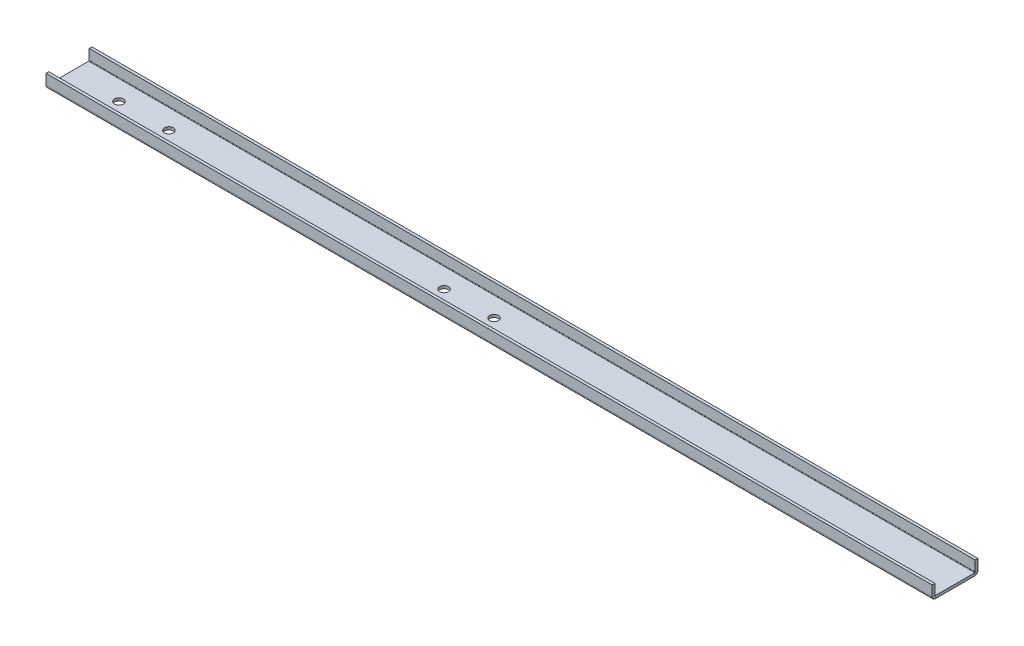
ISO-10303-21;
HEADER;
FILE_DESCRIPTION(('STEP AP214'),'2;1');
FILE_NAME('part.step','',(''),(''),'','','');
FILE_SCHEMA(('AUTOMOTIVE_DESIGN { 1 0 10303 214 1 1 1 1 }'));
ENDSEC;
DATA;
#1=APPLICATION_CONTEXT('core data for automotive mechanical design processes');
#2=APPLICATION_PROTOCOL_DEFINITION('international standard','automotive_design',2000,#1);
#3=PRODUCT_CONTEXT('',#1,'mechanical');
#4=PRODUCT('Part','Part','',(#3));
#5=PRODUCT_RELATED_PRODUCT_CATEGORY('part','',(#4));
#6=PRODUCT_DEFINITION_FORMATION('','',#4);
#7=PRODUCT_DEFINITION_CONTEXT('part definition',#1,'design');
#8=PRODUCT_DEFINITION('design','',#6,#7);
#9=PRODUCT_DEFINITION_SHAPE('','',#8);
#10=(LENGTH_UNIT() NAMED_UNIT(*) SI_UNIT(.MILLI.,.METRE.));
#11=(NAMED_UNIT(*) PLANE_ANGLE_UNIT() SI_UNIT($,.RADIAN.));
#12=(NAMED_UNIT(*) SI_UNIT($,.STERADIAN.) SOLID_ANGLE_UNIT());
#13=UNCERTAINTY_MEASURE_WITH_UNIT(LENGTH_MEASURE(1.E-05),#10,'distance_accuracy_value','');
#14=(GEOMETRIC_REPRESENTATION_CONTEXT(3) GLOBAL_UNCERTAINTY_ASSIGNED_CONTEXT((#13)) GLOBAL_UNIT_ASSIGNED_CONTEXT((#10,
#11,#12)) REPRESENTATION_CONTEXT('',''));
#15=CARTESIAN_POINT('',(0.,0.,0.));
#16=DIRECTION('',(0.,0.,1.));
#17=DIRECTION('',(1.,0.,0.));
#18=AXIS2_PLACEMENT_3D('',#15,#16,#17);
#19=CARTESIAN_POINT('',(450.,1.85,-22.375));
#20=DIRECTION('',(1.,0.,0.));
#21=DIRECTION('',(0.,0.,-1.));
#22=AXIS2_PLACEMENT_3D('',#19,#20,#21);
#23=PLANE('',#22);
#24=DIRECTION('',(0.,0.,-1.));
#25=VECTOR('',#24,1.);
#26=CARTESIAN_POINT('',(450.,1.85,-22.375));
#27=LINE('',#26,#25);
#28=CARTESIAN_POINT('',(450.,1.85,-22.375));
#29=VERTEX_POINT('',#28);
#30=CARTESIAN_POINT('',(450.,1.85,-23.775));
#31=VERTEX_POINT('',#30);
#32=EDGE_CURVE('E11',#29,#31,#27,.T.);
#33=ORIENTED_EDGE('',*,*,#32,.F.);
#34=CARTESIAN_POINT('',(450.,1.85,-22.125));
#35=DIRECTION('',(1.,0.,0.));
#36=DIRECTION('',(0.,0.,-1.));
#37=AXIS2_PLACEMENT_3D('',#34,#35,#36);
#38=CIRCLE('',#37,0.25);
#39=CARTESIAN_POINT('',(450.,1.6,-22.125));
#40=VERTEX_POINT('',#39);
#41=EDGE_CURVE('E149',#29,#40,#38,.F.);
#42=ORIENTED_EDGE('',*,*,#41,.T.);
#43=DIRECTION('',(0.,1.,0.));
#44=VECTOR('',#43,1.);
#45=CARTESIAN_POINT('',(450.,0.199999999999998,-22.125));
#46=LINE('',#45,#44);
#47=CARTESIAN_POINT('',(450.,0.199999999999998,-22.125));
#48=VERTEX_POINT('',#47);
#49=EDGE_CURVE('E47',#48,#40,#46,.T.);
#50=ORIENTED_EDGE('',*,*,#49,.F.);
#51=CARTESIAN_POINT('',(450.,1.85,-22.125));
#52=DIRECTION('',(1.,0.,0.));
#53=DIRECTION('',(0.,0.,-1.));
#54=AXIS2_PLACEMENT_3D('',#51,#52,#53);
#55=CIRCLE('',#54,1.65);
#56=EDGE_CURVE('E244',#31,#48,#55,.F.);
#57=ORIENTED_EDGE('',*,*,#56,.F.);
#58=EDGE_LOOP('',(#33,#42,#50,#57));
#59=FACE_BOUND('',#58,.T.);
#60=ADVANCED_FACE('F39',(#59),#23,.T.);
#61=CARTESIAN_POINT('',(450.,0.199999999999998,-22.125));
#62=DIRECTION('',(1.,0.,0.));
#63=DIRECTION('',(0.,0.,-1.));
#64=AXIS2_PLACEMENT_3D('',#61,#62,#63);
#65=PLANE('',#64);
#66=DIRECTION('',(0.,-1.,0.));
#67=VECTOR('',#66,1.);
#68=CARTESIAN_POINT('',(450.,1.6,-22.375));
#69=LINE('',#68,#67);
#70=CARTESIAN_POINT('',(450.,7.1,-22.375));
#71=VERTEX_POINT('',#70);
#72=EDGE_CURVE('E154',#71,#29,#69,.T.);
#73=ORIENTED_EDGE('',*,*,#72,.T.);
#74=ORIENTED_EDGE('',*,*,#32,.T.);
#75=DIRECTION('',(0.,1.,0.));
#76=VECTOR('',#75,1.);
#77=CARTESIAN_POINT('',(450.,1.6,-23.775));
#78=LINE('',#77,#76);
#79=CARTESIAN_POINT('',(450.,7.1,-23.775));
#80=VERTEX_POINT('',#79);
#81=EDGE_CURVE('E257',#80,#31,#78,.F.);
#82=ORIENTED_EDGE('',*,*,#81,.F.);
#83=DIRECTION('',(0.,0.,-1.));
#84=VECTOR('',#83,1.);
#85=CARTESIAN_POINT('',(450.,7.1,-22.375));
#86=LINE('',#85,#84);
#87=EDGE_CURVE('E259',#71,#80,#86,.T.);
#88=ORIENTED_EDGE('',*,*,#87,.F.);
#89=EDGE_LOOP('',(#73,#74,#82,#88));
#90=FACE_BOUND('',#89,.T.);
#91=ADVANCED_FACE('F270',(#90),#65,.T.);
#92=CARTESIAN_POINT('',(0.,1.6,-22.125));
#93=DIRECTION('',(-1.,0.,0.));
#94=DIRECTION('',(0.,0.,1.));
#95=AXIS2_PLACEMENT_3D('',#92,#93,#94);
#96=PLANE('',#95);
#97=DIRECTION('',(0.,-1.,0.));
#98=VECTOR('',#97,1.);
#99=CARTESIAN_POINT('',(0.,1.6,-22.125));
#100=LINE('',#99,#98);
#101=CARTESIAN_POINT('',(0.,1.6,-22.125));
#102=VERTEX_POINT('',#101);
#103=CARTESIAN_POINT('',(0.,0.199999999999998,-22.125));
#104=VERTEX_POINT('',#103);
#105=EDGE_CURVE('E147',#102,#104,#100,.T.);
#106=ORIENTED_EDGE('',*,*,#105,.F.);
#107=CARTESIAN_POINT('',(0.,1.85,-22.125));
#108=DIRECTION('',(1.,0.,0.));
#109=DIRECTION('',(0.,0.,-1.));
#110=AXIS2_PLACEMENT_3D('',#107,#108,#109);
#111=CIRCLE('',#110,0.25);
#112=CARTESIAN_POINT('',(0.,1.85,-22.375));
#113=VERTEX_POINT('',#112);
#114=EDGE_CURVE('E161',#113,#102,#111,.F.);
#115=ORIENTED_EDGE('',*,*,#114,.F.);
#116=DIRECTION('',(0.,0.,1.));
#117=VECTOR('',#116,1.);
#118=CARTESIAN_POINT('',(0.,1.85,-23.775));
#119=LINE('',#118,#117);
#120=CARTESIAN_POINT('',(0.,1.85,-23.775));
#121=VERTEX_POINT('',#120);
#122=EDGE_CURVE('E235',#121,#113,#119,.T.);
#123=ORIENTED_EDGE('',*,*,#122,.F.);
#124=CARTESIAN_POINT('',(0.,1.85,-22.125));
#125=DIRECTION('',(1.,0.,0.));
#126=DIRECTION('',(0.,0.,-1.));
#127=AXIS2_PLACEMENT_3D('',#124,#125,#126);
#128=CIRCLE('',#127,1.65);
#129=EDGE_CURVE('E189',#121,#104,#128,.F.);
#130=ORIENTED_EDGE('',*,*,#129,.T.);
#131=EDGE_LOOP('',(#106,#115,#123,#130));
#132=FACE_BOUND('',#131,.T.);
#133=ADVANCED_FACE('F249',(#132),#96,.T.);
#134=CARTESIAN_POINT('',(0.,1.85,-23.775));
#135=DIRECTION('',(-1.,0.,0.));
#136=DIRECTION('',(0.,0.,1.));
#137=AXIS2_PLACEMENT_3D('',#134,#135,#136);
#138=PLANE('',#137);
#139=DIRECTION('',(0.,0.,1.));
#140=VECTOR('',#139,1.);
#141=CARTESIAN_POINT('',(0.,1.6,-1.875));
#142=LINE('',#141,#140);
#143=CARTESIAN_POINT('',(0.,1.6,-2.125));
#144=VERTEX_POINT('',#143);
#145=EDGE_CURVE('E202',#102,#144,#142,.T.);
#146=ORIENTED_EDGE('',*,*,#145,.F.);
#147=ORIENTED_EDGE('',*,*,#105,.T.);
#148=DIRECTION('',(0.,0.,1.));
#149=VECTOR('',#148,1.);
#150=CARTESIAN_POINT('',(0.,0.199999999999998,-1.875));
#151=LINE('',#150,#149);
#152=CARTESIAN_POINT('',(0.,0.199999999999998,-2.125));
#153=VERTEX_POINT('',#152);
#154=EDGE_CURVE('E187',#104,#153,#151,.T.);
#155=ORIENTED_EDGE('',*,*,#154,.T.);
#156=DIRECTION('',(0.,1.,0.));
#157=VECTOR('',#156,1.);
#158=CARTESIAN_POINT('',(0.,0.199999999999998,-2.125));
#159=LINE('',#158,#157);
#160=EDGE_CURVE('E96',#153,#144,#159,.T.);
#161=ORIENTED_EDGE('',*,*,#160,.T.);
#162=EDGE_LOOP('',(#146,#147,#155,#161));
#163=FACE_BOUND('',#162,.T.);
#164=ADVANCED_FACE('F237',(#163),#138,.T.);
#165=CARTESIAN_POINT('',(450.,1.6,-2.125));
#166=DIRECTION('',(1.,0.,0.));
#167=DIRECTION('',(0.,0.,-1.));
#168=AXIS2_PLACEMENT_3D('',#165,#166,#167);
#169=PLANE('',#168);
#170=DIRECTION('',(0.,-1.,0.));
#171=VECTOR('',#170,1.);
#172=CARTESIAN_POINT('',(450.,1.6,-2.125));
#173=LINE('',#172,#171);
#174=CARTESIAN_POINT('',(450.,1.6,-2.125));
#175=VERTEX_POINT('',#174);
#176=CARTESIAN_POINT('',(450.,0.199999999999998,-2.125));
#177=VERTEX_POINT('',#176);
#178=EDGE_CURVE('E233',#175,#177,#173,.T.);
#179=ORIENTED_EDGE('',*,*,#178,.F.);
#180=CARTESIAN_POINT('',(450.,1.85,-2.125));
#181=DIRECTION('',(1.,0.,0.));
#182=DIRECTION('',(0.,0.,-1.));
#183=AXIS2_PLACEMENT_3D('',#180,#181,#182);
#184=CIRCLE('',#183,0.25);
#185=CARTESIAN_POINT('',(450.,1.85,-1.875));
#186=VERTEX_POINT('',#185);
#187=EDGE_CURVE('E169',#175,#186,#184,.F.);
#188=ORIENTED_EDGE('',*,*,#187,.T.);
#189=DIRECTION('',(0.,0.,-1.));
#190=VECTOR('',#189,1.);
#191=CARTESIAN_POINT('',(450.,1.85,-0.475));
#192=LINE('',#191,#190);
#193=CARTESIAN_POINT('',(450.,1.85,-0.475));
#194=VERTEX_POINT('',#193);
#195=EDGE_CURVE('E55',#194,#186,#192,.T.);
#196=ORIENTED_EDGE('',*,*,#195,.F.);
#197=CARTESIAN_POINT('',(450.,1.85,-2.125));
#198=DIRECTION('',(1.,0.,0.));
#199=DIRECTION('',(0.,0.,-1.));
#200=AXIS2_PLACEMENT_3D('',#197,#198,#199);
#201=CIRCLE('',#200,1.65);
#202=EDGE_CURVE('E261',#177,#194,#201,.F.);
#203=ORIENTED_EDGE('',*,*,#202,.F.);
#204=EDGE_LOOP('',(#179,#188,#196,#203));
#205=FACE_BOUND('',#204,.T.);
#206=ADVANCED_FACE('F296',(#205),#169,.T.);
#207=CARTESIAN_POINT('',(450.,1.85,-0.475));
#208=DIRECTION('',(1.,0.,0.));
#209=DIRECTION('',(0.,0.,-1.));
#210=AXIS2_PLACEMENT_3D('',#207,#208,#209);
#211=PLANE('',#210);
#212=DIRECTION('',(0.,0.,1.));
#213=VECTOR('',#212,1.);
#214=CARTESIAN_POINT('',(450.,1.6,-1.875));
#215=LINE('',#214,#213);
#216=EDGE_CURVE('E139',#40,#175,#215,.T.);
#217=ORIENTED_EDGE('',*,*,#216,.T.);
#218=ORIENTED_EDGE('',*,*,#178,.T.);
#219=DIRECTION('',(0.,0.,1.));
#220=VECTOR('',#219,1.);
#221=CARTESIAN_POINT('',(450.,0.199999999999998,-1.875));
#222=LINE('',#221,#220);
#223=EDGE_CURVE('E142',#48,#177,#222,.T.);
#224=ORIENTED_EDGE('',*,*,#223,.F.);
#225=ORIENTED_EDGE('',*,*,#49,.T.);
#226=EDGE_LOOP('',(#217,#218,#224,#225));
#227=FACE_BOUND('',#226,.T.);
#228=ADVANCED_FACE('F137',(#227),#211,.T.);
#229=CARTESIAN_POINT('',(0.,1.85,-1.875));
#230=DIRECTION('',(-1.,0.,0.));
#231=DIRECTION('',(0.,0.,1.));
#232=AXIS2_PLACEMENT_3D('',#229,#230,#231);
#233=PLANE('',#232);
#234=DIRECTION('',(0.,0.,1.));
#235=VECTOR('',#234,1.);
#236=CARTESIAN_POINT('',(0.,1.85,-1.875));
#237=LINE('',#236,#235);
#238=CARTESIAN_POINT('',(0.,1.85,-1.875));
#239=VERTEX_POINT('',#238);
#240=CARTESIAN_POINT('',(0.,1.85,-0.475));
#241=VERTEX_POINT('',#240);
#242=EDGE_CURVE('E103',#239,#241,#237,.T.);
#243=ORIENTED_EDGE('',*,*,#242,.F.);
#244=CARTESIAN_POINT('',(0.,1.85,-2.125));
#245=DIRECTION('',(1.,0.,0.));
#246=DIRECTION('',(0.,0.,-1.));
#247=AXIS2_PLACEMENT_3D('',#244,#245,#246);
#248=CIRCLE('',#247,0.25);
#249=EDGE_CURVE('E204',#144,#239,#248,.F.);
#250=ORIENTED_EDGE('',*,*,#249,.F.);
#251=ORIENTED_EDGE('',*,*,#160,.F.);
#252=CARTESIAN_POINT('',(0.,1.85,-2.125));
#253=DIRECTION('',(1.,0.,0.));
#254=DIRECTION('',(0.,0.,-1.));
#255=AXIS2_PLACEMENT_3D('',#252,#253,#254);
#256=CIRCLE('',#255,1.65);
#257=EDGE_CURVE('E185',#153,#241,#256,.F.);
#258=ORIENTED_EDGE('',*,*,#257,.T.);
#259=EDGE_LOOP('',(#243,#250,#251,#258));
#260=FACE_BOUND('',#259,.T.);
#261=ADVANCED_FACE('F302',(#260),#233,.T.);
#262=CARTESIAN_POINT('',(0.,0.199999999999998,-2.125));
#263=DIRECTION('',(-1.,0.,0.));
#264=DIRECTION('',(0.,0.,1.));
#265=AXIS2_PLACEMENT_3D('',#262,#263,#264);
#266=PLANE('',#265);
#267=DIRECTION('',(0.,1.,0.));
#268=VECTOR('',#267,1.);
#269=CARTESIAN_POINT('',(0.,1.6,-1.875));
#270=LINE('',#269,#268);
#271=CARTESIAN_POINT('',(0.,7.1,-1.875));
#272=VERTEX_POINT('',#271);
#273=EDGE_CURVE('E175',#239,#272,#270,.T.);
#274=ORIENTED_EDGE('',*,*,#273,.F.);
#275=ORIENTED_EDGE('',*,*,#242,.T.);
#276=DIRECTION('',(0.,1.,0.));
#277=VECTOR('',#276,1.);
#278=CARTESIAN_POINT('',(0.,1.6,-0.475));
#279=LINE('',#278,#277);
#280=CARTESIAN_POINT('',(0.,7.1,-0.475));
#281=VERTEX_POINT('',#280);
#282=EDGE_CURVE('E182',#241,#281,#279,.T.);
#283=ORIENTED_EDGE('',*,*,#282,.T.);
#284=DIRECTION('',(0.,0.,-1.));
#285=VECTOR('',#284,1.);
#286=CARTESIAN_POINT('',(0.,7.1,-0.475));
#287=LINE('',#286,#285);
#288=EDGE_CURVE('E178',#281,#272,#287,.T.);
#289=ORIENTED_EDGE('',*,*,#288,.T.);
#290=EDGE_LOOP('',(#274,#275,#283,#289));
#291=FACE_BOUND('',#290,.T.);
#292=ADVANCED_FACE('F305',(#291),#266,.T.);
#293=CARTESIAN_POINT('',(450.,1.6,-1.875));
#294=DIRECTION('',(0.,0.,1.));
#295=DIRECTION('',(0.,-1.,0.));
#296=AXIS2_PLACEMENT_3D('',#293,#294,#295);
#297=PLANE('',#296);
#298=ORIENTED_EDGE('',*,*,#273,.T.);
#299=DIRECTION('',(-1.,0.,0.));
#300=VECTOR('',#299,1.);
#301=CARTESIAN_POINT('',(450.,7.1,-1.875));
#302=LINE('',#301,#300);
#303=CARTESIAN_POINT('',(450.,7.1,-1.875));
#304=VERTEX_POINT('',#303);
#305=EDGE_CURVE('E228',#304,#272,#302,.T.);
#306=ORIENTED_EDGE('',*,*,#305,.F.);
#307=DIRECTION('',(0.,1.,0.));
#308=VECTOR('',#307,1.);
#309=CARTESIAN_POINT('',(450.,1.6,-1.875));
#310=LINE('',#309,#308);
#311=EDGE_CURVE('E109',#186,#304,#310,.T.);
#312=ORIENTED_EDGE('',*,*,#311,.F.);
#313=DIRECTION('',(-1.,0.,0.));
#314=VECTOR('',#313,1.);
#315=CARTESIAN_POINT('',(450.,1.85,-1.875));
#316=LINE('',#315,#314);
#317=EDGE_CURVE('E171',#186,#239,#316,.T.);
#318=ORIENTED_EDGE('',*,*,#317,.T.);
#319=EDGE_LOOP('',(#298,#306,#312,#318));
#320=FACE_BOUND('',#319,.T.);
#321=ADVANCED_FACE('F308',(#320),#297,.F.);
#322=CARTESIAN_POINT('',(450.,7.1,-0.475));
#323=DIRECTION('',(0.,1.,0.));
#324=DIRECTION('',(0.,0.,1.));
#325=AXIS2_PLACEMENT_3D('',#322,#323,#324);
#326=PLANE('',#325);
#327=ORIENTED_EDGE('',*,*,#288,.F.);
#328=DIRECTION('',(-1.,0.,0.));
#329=VECTOR('',#328,1.);
#330=CARTESIAN_POINT('',(450.,7.1,-0.475));
#331=LINE('',#330,#329);
#332=CARTESIAN_POINT('',(450.,7.1,-0.475));
#333=VERTEX_POINT('',#332);
#334=EDGE_CURVE('E226',#333,#281,#331,.T.);
#335=ORIENTED_EDGE('',*,*,#334,.F.);
#336=DIRECTION('',(0.,0.,-1.));
#337=VECTOR('',#336,1.);
#338=CARTESIAN_POINT('',(450.,7.1,-0.475));
#339=LINE('',#338,#337);
#340=EDGE_CURVE('E589',#333,#304,#339,.T.);
#341=ORIENTED_EDGE('',*,*,#340,.T.);
#342=ORIENTED_EDGE('',*,*,#305,.T.);
#343=EDGE_LOOP('',(#327,#335,#341,#342));
#344=FACE_BOUND('',#343,.T.);
#345=ADVANCED_FACE('F312',(#344),#326,.T.);
#346=CARTESIAN_POINT('',(450.,1.6,-0.475));
#347=DIRECTION('',(0.,0.,1.));
#348=DIRECTION('',(0.,-1.,0.));
#349=AXIS2_PLACEMENT_3D('',#346,#347,#348);
#350=PLANE('',#349);
#351=ORIENTED_EDGE('',*,*,#282,.F.);
#352=DIRECTION('',(-1.,0.,0.));
#353=VECTOR('',#352,1.);
#354=CARTESIAN_POINT('',(450.,1.85,-0.475));
#355=LINE('',#354,#353);
#356=EDGE_CURVE('E223',#194,#241,#355,.T.);
#357=ORIENTED_EDGE('',*,*,#356,.F.);
#358=DIRECTION('',(0.,1.,0.));
#359=VECTOR('',#358,1.);
#360=CARTESIAN_POINT('',(450.,1.6,-0.475));
#361=LINE('',#360,#359);
#362=EDGE_CURVE('E592',#194,#333,#361,.T.);
#363=ORIENTED_EDGE('',*,*,#362,.T.);
#364=ORIENTED_EDGE('',*,*,#334,.T.);
#365=EDGE_LOOP('',(#351,#357,#363,#364));
#366=FACE_BOUND('',#365,.T.);
#367=ADVANCED_FACE('F316',(#366),#350,.T.);
#368=CARTESIAN_POINT('',(450.,1.85,-2.125));
#369=DIRECTION('',(-1.,0.,0.));
#370=DIRECTION('',(0.,0.,1.));
#371=AXIS2_PLACEMENT_3D('',#368,#369,#370);
#372=CYLINDRICAL_SURFACE('',#371,1.65);
#373=ORIENTED_EDGE('',*,*,#257,.F.);
#374=DIRECTION('',(-1.,0.,0.));
#375=VECTOR('',#374,1.);
#376=CARTESIAN_POINT('',(450.,0.199999999999998,-2.125));
#377=LINE('',#376,#375);
#378=EDGE_CURVE('E220',#177,#153,#377,.T.);
#379=ORIENTED_EDGE('',*,*,#378,.F.);
#380=ORIENTED_EDGE('',*,*,#202,.T.);
#381=ORIENTED_EDGE('',*,*,#356,.T.);
#382=EDGE_LOOP('',(#373,#379,#380,#381));
#383=FACE_BOUND('',#382,.T.);
#384=ADVANCED_FACE('F320',(#383),#372,.T.);
#385=CARTESIAN_POINT('',(450.,0.199999999999998,-1.875));
#386=DIRECTION('',(0.,-1.,0.));
#387=DIRECTION('',(0.,0.,-1.));
#388=AXIS2_PLACEMENT_3D('',#385,#386,#387);
#389=PLANE('',#388);
#390=CARTESIAN_POINT('',(215.9,0.199999999999998,-12.125));
#391=DIRECTION('',(0.,-1.,0.));
#392=DIRECTION('',(0.,0.,-1.));
#393=AXIS2_PLACEMENT_3D('',#390,#391,#392);
#394=CIRCLE('',#393,2.25424999999999);
#395=CARTESIAN_POINT('',(215.9,0.199999999999998,-14.37925));
#396=VERTEX_POINT('',#395);
#397=EDGE_CURVE('E566',#396,#396,#394,.T.);
#398=ORIENTED_EDGE('',*,*,#397,.F.);
#399=EDGE_LOOP('',(#398));
#400=FACE_BOUND('',#399,.T.);
#401=CARTESIAN_POINT('',(190.5,0.199999999999998,-12.125));
#402=DIRECTION('',(0.,-1.,0.));
#403=DIRECTION('',(0.,0.,-1.));
#404=AXIS2_PLACEMENT_3D('',#401,#402,#403);
#405=CIRCLE('',#404,2.25424999999999);
#406=CARTESIAN_POINT('',(190.5,0.199999999999998,-14.37925));
#407=VERTEX_POINT('',#406);
#408=EDGE_CURVE('E571',#407,#407,#405,.T.);
#409=ORIENTED_EDGE('',*,*,#408,.F.);
#410=EDGE_LOOP('',(#409));
#411=FACE_BOUND('',#410,.T.);
#412=CARTESIAN_POINT('',(50.8,0.199999999999998,-12.125));
#413=DIRECTION('',(0.,-1.,0.));
#414=DIRECTION('',(0.,0.,-1.));
#415=AXIS2_PLACEMENT_3D('',#412,#413,#414);
#416=CIRCLE('',#415,2.25425);
#417=CARTESIAN_POINT('',(50.8,0.199999999999998,-14.37925));
#418=VERTEX_POINT('',#417);
#419=EDGE_CURVE('E577',#418,#418,#416,.T.);
#420=ORIENTED_EDGE('',*,*,#419,.F.);
#421=EDGE_LOOP('',(#420));
#422=FACE_BOUND('',#421,.T.);
#423=CARTESIAN_POINT('',(25.4,0.199999999999998,-12.125));
#424=DIRECTION('',(0.,-1.,0.));
#425=DIRECTION('',(0.,0.,-1.));
#426=AXIS2_PLACEMENT_3D('',#423,#424,#425);
#427=CIRCLE('',#426,2.25425);
#428=CARTESIAN_POINT('',(25.4,0.199999999999998,-14.37925));
#429=VERTEX_POINT('',#428);
#430=EDGE_CURVE('E583',#429,#429,#427,.T.);
#431=ORIENTED_EDGE('',*,*,#430,.F.);
#432=EDGE_LOOP('',(#431));
#433=FACE_BOUND('',#432,.T.);
#434=ORIENTED_EDGE('',*,*,#154,.F.);
#435=DIRECTION('',(-1.,0.,0.));
#436=VECTOR('',#435,1.);
#437=CARTESIAN_POINT('',(450.,0.199999999999998,-22.125));
#438=LINE('',#437,#436);
#439=EDGE_CURVE('E217',#48,#104,#438,.T.);
#440=ORIENTED_EDGE('',*,*,#439,.F.);
#441=ORIENTED_EDGE('',*,*,#223,.T.);
#442=ORIENTED_EDGE('',*,*,#378,.T.);
#443=EDGE_LOOP('',(#434,#440,#441,#442));
#444=FACE_BOUND('',#443,.T.);
#445=ADVANCED_FACE('F246',(#400,#411,#422,#433,#444),#389,.T.);
#446=CARTESIAN_POINT('',(450.,1.85,-22.125));
#447=DIRECTION('',(-1.,0.,0.));
#448=DIRECTION('',(0.,0.,1.));
#449=AXIS2_PLACEMENT_3D('',#446,#447,#448);
#450=CYLINDRICAL_SURFACE('',#449,1.65);
#451=ORIENTED_EDGE('',*,*,#129,.F.);
#452=DIRECTION('',(-1.,0.,0.));
#453=VECTOR('',#452,1.);
#454=CARTESIAN_POINT('',(450.,1.85,-23.775));
#455=LINE('',#454,#453);
#456=EDGE_CURVE('E214',#31,#121,#455,.T.);
#457=ORIENTED_EDGE('',*,*,#456,.F.);
#458=ORIENTED_EDGE('',*,*,#56,.T.);
#459=ORIENTED_EDGE('',*,*,#439,.T.);
#460=EDGE_LOOP('',(#451,#457,#458,#459));
#461=FACE_BOUND('',#460,.T.);
#462=ADVANCED_FACE('F242',(#461),#450,.T.);
#463=CARTESIAN_POINT('',(450.,1.6,-23.775));
#464=DIRECTION('',(0.,0.,-1.));
#465=DIRECTION('',(-1.,0.,0.));
#466=AXIS2_PLACEMENT_3D('',#463,#464,#465);
#467=PLANE('',#466);
#468=DIRECTION('',(0.,1.,0.));
#469=VECTOR('',#468,1.);
#470=CARTESIAN_POINT('',(0.,1.6,-23.775));
#471=LINE('',#470,#469);
#472=CARTESIAN_POINT('',(0.,7.1,-23.775));
#473=VERTEX_POINT('',#472);
#474=EDGE_CURVE('E192',#473,#121,#471,.F.);
#475=ORIENTED_EDGE('',*,*,#474,.F.);
#476=DIRECTION('',(-1.,0.,0.));
#477=VECTOR('',#476,1.);
#478=CARTESIAN_POINT('',(450.,7.1,-23.775));
#479=LINE('',#478,#477);
#480=EDGE_CURVE('E212',#80,#473,#479,.T.);
#481=ORIENTED_EDGE('',*,*,#480,.F.);
#482=ORIENTED_EDGE('',*,*,#81,.T.);
#483=ORIENTED_EDGE('',*,*,#456,.T.);
#484=EDGE_LOOP('',(#475,#481,#482,#483));
#485=FACE_BOUND('',#484,.T.);
#486=ADVANCED_FACE('F255',(#485),#467,.T.);
#487=CARTESIAN_POINT('',(450.,7.1,-22.375));
#488=DIRECTION('',(0.,1.,0.));
#489=DIRECTION('',(0.,0.,1.));
#490=AXIS2_PLACEMENT_3D('',#487,#488,#489);
#491=PLANE('',#490);
#492=DIRECTION('',(0.,0.,-1.));
#493=VECTOR('',#492,1.);
#494=CARTESIAN_POINT('',(0.,7.1,-22.375));
#495=LINE('',#494,#493);
#496=CARTESIAN_POINT('',(0.,7.1,-22.375));
#497=VERTEX_POINT('',#496);
#498=EDGE_CURVE('E195',#497,#473,#495,.T.);
#499=ORIENTED_EDGE('',*,*,#498,.F.);
#500=DIRECTION('',(-1.,0.,0.));
#501=VECTOR('',#500,1.);
#502=CARTESIAN_POINT('',(450.,7.1,-22.375));
#503=LINE('',#502,#501);
#504=EDGE_CURVE('E210',#71,#497,#503,.T.);
#505=ORIENTED_EDGE('',*,*,#504,.F.);
#506=ORIENTED_EDGE('',*,*,#87,.T.);
#507=ORIENTED_EDGE('',*,*,#480,.T.);
#508=EDGE_LOOP('',(#499,#505,#506,#507));
#509=FACE_BOUND('',#508,.T.);
#510=ADVANCED_FACE('F276',(#509),#491,.T.);
#511=CARTESIAN_POINT('',(450.,1.6,-22.375));
#512=DIRECTION('',(0.,0.,-1.));
#513=DIRECTION('',(-1.,0.,0.));
#514=AXIS2_PLACEMENT_3D('',#511,#512,#513);
#515=PLANE('',#514);
#516=DIRECTION('',(0.,-1.,0.));
#517=VECTOR('',#516,1.);
#518=CARTESIAN_POINT('',(0.,1.6,-22.375));
#519=LINE('',#518,#517);
#520=EDGE_CURVE('E198',#497,#113,#519,.T.);
#521=ORIENTED_EDGE('',*,*,#520,.T.);
#522=DIRECTION('',(-1.,0.,0.));
#523=VECTOR('',#522,1.);
#524=CARTESIAN_POINT('',(450.,1.85,-22.375));
#525=LINE('',#524,#523);
#526=EDGE_CURVE('E163',#29,#113,#525,.T.);
#527=ORIENTED_EDGE('',*,*,#526,.F.);
#528=ORIENTED_EDGE('',*,*,#72,.F.);
#529=ORIENTED_EDGE('',*,*,#504,.T.);
#530=EDGE_LOOP('',(#521,#527,#528,#529));
#531=FACE_BOUND('',#530,.T.);
#532=ADVANCED_FACE('F272',(#531),#515,.F.);
#533=CARTESIAN_POINT('',(450.,1.85,-22.125));
#534=DIRECTION('',(-1.,0.,0.));
#535=DIRECTION('',(0.,0.,1.));
#536=AXIS2_PLACEMENT_3D('',#533,#534,#535);
#537=CYLINDRICAL_SURFACE('',#536,0.25);
#538=ORIENTED_EDGE('',*,*,#114,.T.);
#539=DIRECTION('',(-1.,0.,0.));
#540=VECTOR('',#539,1.);
#541=CARTESIAN_POINT('',(450.,1.6,-22.125));
#542=LINE('',#541,#540);
#543=EDGE_CURVE('E158',#40,#102,#542,.T.);
#544=ORIENTED_EDGE('',*,*,#543,.F.);
#545=ORIENTED_EDGE('',*,*,#41,.F.);
#546=ORIENTED_EDGE('',*,*,#526,.T.);
#547=EDGE_LOOP('',(#538,#544,#545,#546));
#548=FACE_BOUND('',#547,.T.);
#549=ADVANCED_FACE('F159',(#548),#537,.F.);
#550=CARTESIAN_POINT('',(450.,1.6,-1.875));
#551=DIRECTION('',(0.,-1.,0.));
#552=DIRECTION('',(0.,0.,-1.));
#553=AXIS2_PLACEMENT_3D('',#550,#551,#552);
#554=PLANE('',#553);
#555=CARTESIAN_POINT('',(215.9,1.6,-12.125));
#556=DIRECTION('',(0.,-1.,0.));
#557=DIRECTION('',(0.,0.,-1.));
#558=AXIS2_PLACEMENT_3D('',#555,#556,#557);
#559=CIRCLE('',#558,2.25424999999999);
#560=CARTESIAN_POINT('',(215.9,1.6,-14.37925));
#561=VERTEX_POINT('',#560);
#562=EDGE_CURVE('E179',#561,#561,#559,.F.);
#563=ORIENTED_EDGE('',*,*,#562,.F.);
#564=EDGE_LOOP('',(#563));
#565=FACE_BOUND('',#564,.T.);
#566=CARTESIAN_POINT('',(190.5,1.6,-12.125));
#567=DIRECTION('',(0.,-1.,0.));
#568=DIRECTION('',(0.,0.,-1.));
#569=AXIS2_PLACEMENT_3D('',#566,#567,#568);
#570=CIRCLE('',#569,2.25424999999999);
#571=CARTESIAN_POINT('',(190.5,1.6,-14.37925));
#572=VERTEX_POINT('',#571);
#573=EDGE_CURVE('E567',#572,#572,#570,.F.);
#574=ORIENTED_EDGE('',*,*,#573,.F.);
#575=EDGE_LOOP('',(#574));
#576=FACE_BOUND('',#575,.T.);
#577=CARTESIAN_POINT('',(50.8,1.6,-12.125));
#578=DIRECTION('',(0.,-1.,0.));
#579=DIRECTION('',(0.,0.,-1.));
#580=AXIS2_PLACEMENT_3D('',#577,#578,#579);
#581=CIRCLE('',#580,2.25425);
#582=CARTESIAN_POINT('',(50.8,1.6,-14.37925));
#583=VERTEX_POINT('',#582);
#584=EDGE_CURVE('E575',#583,#583,#581,.F.);
#585=ORIENTED_EDGE('',*,*,#584,.F.);
#586=EDGE_LOOP('',(#585));
#587=FACE_BOUND('',#586,.T.);
#588=CARTESIAN_POINT('',(25.4,1.6,-12.125));
#589=DIRECTION('',(0.,-1.,0.));
#590=DIRECTION('',(0.,0.,-1.));
#591=AXIS2_PLACEMENT_3D('',#588,#589,#590);
#592=CIRCLE('',#591,2.25425);
#593=CARTESIAN_POINT('',(25.4,1.6,-14.37925));
#594=VERTEX_POINT('',#593);
#595=EDGE_CURVE('E580',#594,#594,#592,.F.);
#596=ORIENTED_EDGE('',*,*,#595,.F.);
#597=EDGE_LOOP('',(#596));
#598=FACE_BOUND('',#597,.T.);
#599=ORIENTED_EDGE('',*,*,#145,.T.);
#600=DIRECTION('',(-1.,0.,0.));
#601=VECTOR('',#600,1.);
#602=CARTESIAN_POINT('',(450.,1.6,-2.125));
#603=LINE('',#602,#601);
#604=EDGE_CURVE('E164',#175,#144,#603,.T.);
#605=ORIENTED_EDGE('',*,*,#604,.F.);
#606=ORIENTED_EDGE('',*,*,#216,.F.);
#607=ORIENTED_EDGE('',*,*,#543,.T.);
#608=EDGE_LOOP('',(#599,#605,#606,#607));
#609=FACE_BOUND('',#608,.T.);
#610=ADVANCED_FACE('F166',(#565,#576,#587,#598,#609),#554,.F.);
#611=CARTESIAN_POINT('',(450.,1.85,-2.125));
#612=DIRECTION('',(-1.,0.,0.));
#613=DIRECTION('',(0.,0.,1.));
#614=AXIS2_PLACEMENT_3D('',#611,#612,#613);
#615=CYLINDRICAL_SURFACE('',#614,0.25);
#616=ORIENTED_EDGE('',*,*,#249,.T.);
#617=ORIENTED_EDGE('',*,*,#317,.F.);
#618=ORIENTED_EDGE('',*,*,#187,.F.);
#619=ORIENTED_EDGE('',*,*,#604,.T.);
#620=EDGE_LOOP('',(#616,#617,#618,#619));
#621=FACE_BOUND('',#620,.T.);
#622=ADVANCED_FACE('F367',(#621),#615,.F.);
#623=CARTESIAN_POINT('',(450.,1.85,-2.125));
#624=DIRECTION('',(1.,0.,0.));
#625=DIRECTION('',(0.,0.,-1.));
#626=AXIS2_PLACEMENT_3D('',#623,#624,#625);
#627=PLANE('',#626);
#628=ORIENTED_EDGE('',*,*,#311,.T.);
#629=ORIENTED_EDGE('',*,*,#340,.F.);
#630=ORIENTED_EDGE('',*,*,#362,.F.);
#631=ORIENTED_EDGE('',*,*,#195,.T.);
#632=EDGE_LOOP('',(#628,#629,#630,#631));
#633=FACE_BOUND('',#632,.T.);
#634=ADVANCED_FACE('F372',(#633),#627,.T.);
#635=CARTESIAN_POINT('',(0.,1.85,-2.125));
#636=DIRECTION('',(1.,0.,0.));
#637=DIRECTION('',(0.,0.,-1.));
#638=AXIS2_PLACEMENT_3D('',#635,#636,#637);
#639=PLANE('',#638);
#640=ORIENTED_EDGE('',*,*,#474,.T.);
#641=ORIENTED_EDGE('',*,*,#122,.T.);
#642=ORIENTED_EDGE('',*,*,#520,.F.);
#643=ORIENTED_EDGE('',*,*,#498,.T.);
#644=EDGE_LOOP('',(#640,#641,#642,#643));
#645=FACE_BOUND('',#644,.T.);
#646=ADVANCED_FACE('F274',(#645),#639,.F.);
#647=CARTESIAN_POINT('',(25.4,7.97598184595909,-12.125));
#648=DIRECTION('',(0.,-1.,0.));
#649=DIRECTION('',(0.,0.,-1.));
#650=AXIS2_PLACEMENT_3D('',#647,#648,#649);
#651=CYLINDRICAL_SURFACE('',#650,2.25425);
#652=ORIENTED_EDGE('',*,*,#595,.T.);
#653=EDGE_LOOP('',(#652));
#654=FACE_BOUND('',#653,.T.);
#655=ORIENTED_EDGE('',*,*,#430,.T.);
#656=EDGE_LOOP('',(#655));
#657=FACE_BOUND('',#656,.T.);
#658=ADVANCED_FACE('F391',(#654,#657),#651,.F.);
#659=CARTESIAN_POINT('',(50.8,7.97598184595909,-12.125));
#660=DIRECTION('',(0.,-1.,0.));
#661=DIRECTION('',(0.,0.,-1.));
#662=AXIS2_PLACEMENT_3D('',#659,#660,#661);
#663=CYLINDRICAL_SURFACE('',#662,2.25425);
#664=ORIENTED_EDGE('',*,*,#584,.T.);
#665=EDGE_LOOP('',(#664));
#666=FACE_BOUND('',#665,.T.);
#667=ORIENTED_EDGE('',*,*,#419,.T.);
#668=EDGE_LOOP('',(#667));
#669=FACE_BOUND('',#668,.T.);
#670=ADVANCED_FACE('F416',(#666,#669),#663,.F.);
#671=CARTESIAN_POINT('',(190.5,7.97598184595909,-12.125));
#672=DIRECTION('',(0.,-1.,0.));
#673=DIRECTION('',(0.,0.,-1.));
#674=AXIS2_PLACEMENT_3D('',#671,#672,#673);
#675=CYLINDRICAL_SURFACE('',#674,2.25424999999999);
#676=ORIENTED_EDGE('',*,*,#573,.T.);
#677=EDGE_LOOP('',(#676));
#678=FACE_BOUND('',#677,.T.);
#679=ORIENTED_EDGE('',*,*,#408,.T.);
#680=EDGE_LOOP('',(#679));
#681=FACE_BOUND('',#680,.T.);
#682=ADVANCED_FACE('F427',(#678,#681),#675,.F.);
#683=CARTESIAN_POINT('',(215.9,7.97598184595909,-12.125));
#684=DIRECTION('',(0.,-1.,0.));
#685=DIRECTION('',(0.,0.,-1.));
#686=AXIS2_PLACEMENT_3D('',#683,#684,#685);
#687=CYLINDRICAL_SURFACE('',#686,2.25424999999999);
#688=ORIENTED_EDGE('',*,*,#562,.T.);
#689=EDGE_LOOP('',(#688));
#690=FACE_BOUND('',#689,.T.);
#691=ORIENTED_EDGE('',*,*,#397,.T.);
#692=EDGE_LOOP('',(#691));
#693=FACE_BOUND('',#692,.T.);
#694=ADVANCED_FACE('F438',(#690,#693),#687,.F.);
#695=CLOSED_SHELL('',(#60,#91,#133,#164,#206,#228,#261,#292,#321,#345,#367,#384,#445,#462,#486,
#510,#532,#549,#610,#622,#634,#646,#658,#670,#682,#694));
#696=MANIFOLD_SOLID_BREP('B2',#695);
#697=ADVANCED_BREP_SHAPE_REPRESENTATION('',(#18,#696),#14);
#698=SHAPE_DEFINITION_REPRESENTATION(#9,#697);
ENDSEC;
END-ISO-10303-21;
